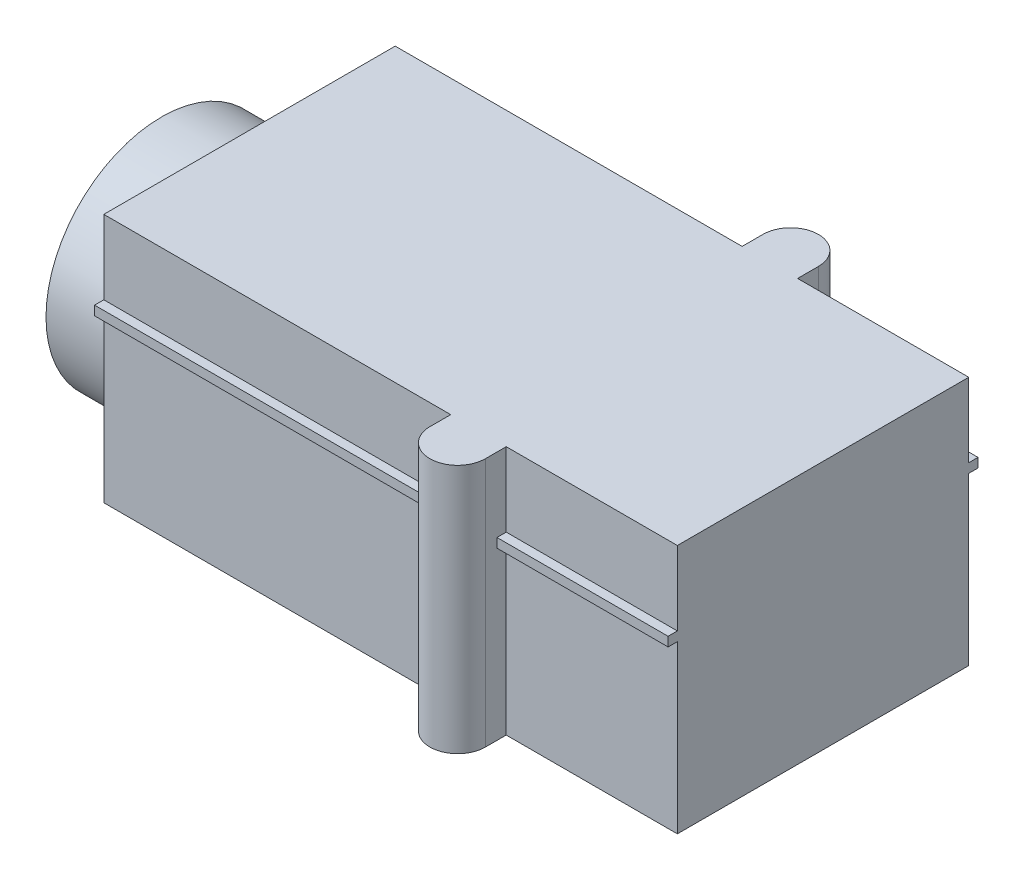
ISO-10303-21;
HEADER;
FILE_DESCRIPTION(('STEP AP214'),'2;1');
FILE_NAME('part.step','',(''),(''),'','','');
FILE_SCHEMA(('AUTOMOTIVE_DESIGN { 1 0 10303 214 1 1 1 1 }'));
ENDSEC;
DATA;
#1=APPLICATION_CONTEXT('core data for automotive mechanical design processes');
#2=APPLICATION_PROTOCOL_DEFINITION('international standard','automotive_design',2000,#1);
#3=PRODUCT_CONTEXT('',#1,'mechanical');
#4=PRODUCT('Part','Part','',(#3));
#5=PRODUCT_RELATED_PRODUCT_CATEGORY('part','',(#4));
#6=PRODUCT_DEFINITION_FORMATION('','',#4);
#7=PRODUCT_DEFINITION_CONTEXT('part definition',#1,'design');
#8=PRODUCT_DEFINITION('design','',#6,#7);
#9=PRODUCT_DEFINITION_SHAPE('','',#8);
#10=(LENGTH_UNIT() NAMED_UNIT(*) SI_UNIT(.MILLI.,.METRE.));
#11=(NAMED_UNIT(*) PLANE_ANGLE_UNIT() SI_UNIT($,.RADIAN.));
#12=(NAMED_UNIT(*) SI_UNIT($,.STERADIAN.) SOLID_ANGLE_UNIT());
#13=UNCERTAINTY_MEASURE_WITH_UNIT(LENGTH_MEASURE(1.E-05),#10,'distance_accuracy_value','');
#14=(GEOMETRIC_REPRESENTATION_CONTEXT(3) GLOBAL_UNCERTAINTY_ASSIGNED_CONTEXT((#13)) GLOBAL_UNIT_ASSIGNED_CONTEXT((#10,
#11,#12)) REPRESENTATION_CONTEXT('',''));
#15=CARTESIAN_POINT('',(0.,0.,0.));
#16=DIRECTION('',(0.,0.,1.));
#17=DIRECTION('',(1.,0.,0.));
#18=AXIS2_PLACEMENT_3D('',#15,#16,#17);
#19=CARTESIAN_POINT('',(7.5,5.4,3.15));
#20=DIRECTION('',(0.,0.,-1.));
#21=DIRECTION('',(-1.,0.,0.));
#22=AXIS2_PLACEMENT_3D('',#19,#20,#21);
#23=PLANE('',#22);
#24=DIRECTION('',(1.,0.,0.));
#25=VECTOR('',#24,1.);
#26=CARTESIAN_POINT('',(7.5,3.6,3.15));
#27=LINE('',#26,#25);
#28=CARTESIAN_POINT('',(0.,3.6,3.15));
#29=VERTEX_POINT('',#28);
#30=CARTESIAN_POINT('',(7.5,3.6,3.15));
#31=VERTEX_POINT('',#30);
#32=EDGE_CURVE('E48',#29,#31,#27,.T.);
#33=ORIENTED_EDGE('',*,*,#32,.F.);
#34=DIRECTION('',(0.,-1.,0.));
#35=VECTOR('',#34,1.);
#36=CARTESIAN_POINT('',(0.,5.4,3.15));
#37=LINE('',#36,#35);
#38=CARTESIAN_POINT('',(0.,0.,3.15));
#39=VERTEX_POINT('',#38);
#40=EDGE_CURVE('E355',#29,#39,#37,.T.);
#41=ORIENTED_EDGE('',*,*,#40,.T.);
#42=DIRECTION('',(1.,0.,0.));
#43=VECTOR('',#42,1.);
#44=CARTESIAN_POINT('',(7.5,0.,3.15));
#45=LINE('',#44,#43);
#46=CARTESIAN_POINT('',(7.5,0.,3.15));
#47=VERTEX_POINT('',#46);
#48=EDGE_CURVE('E325',#39,#47,#45,.T.);
#49=ORIENTED_EDGE('',*,*,#48,.T.);
#50=DIRECTION('',(0.,-1.,0.));
#51=VECTOR('',#50,1.);
#52=CARTESIAN_POINT('',(7.5,5.4,3.15));
#53=LINE('',#52,#51);
#54=EDGE_CURVE('E422',#31,#47,#53,.T.);
#55=ORIENTED_EDGE('',*,*,#54,.F.);
#56=EDGE_LOOP('',(#33,#41,#49,#55));
#57=FACE_BOUND('',#56,.T.);
#58=ADVANCED_FACE('F33',(#57),#23,.F.);
#59=CARTESIAN_POINT('',(12.4,5.4,3.15));
#60=DIRECTION('',(0.,0.,-1.));
#61=DIRECTION('',(-1.,0.,0.));
#62=AXIS2_PLACEMENT_3D('',#59,#60,#61);
#63=PLANE('',#62);
#64=DIRECTION('',(1.,0.,0.));
#65=VECTOR('',#64,1.);
#66=CARTESIAN_POINT('',(12.4,3.6,3.15));
#67=LINE('',#66,#65);
#68=CARTESIAN_POINT('',(8.7,3.6,3.15));
#69=VERTEX_POINT('',#68);
#70=CARTESIAN_POINT('',(12.4,3.6,3.15));
#71=VERTEX_POINT('',#70);
#72=EDGE_CURVE('E294',#69,#71,#67,.T.);
#73=ORIENTED_EDGE('',*,*,#72,.F.);
#74=DIRECTION('',(0.,-1.,0.));
#75=VECTOR('',#74,1.);
#76=CARTESIAN_POINT('',(8.7,5.4,3.15));
#77=LINE('',#76,#75);
#78=CARTESIAN_POINT('',(8.7,0.,3.15));
#79=VERTEX_POINT('',#78);
#80=EDGE_CURVE('E412',#69,#79,#77,.T.);
#81=ORIENTED_EDGE('',*,*,#80,.T.);
#82=DIRECTION('',(1.,0.,0.));
#83=VECTOR('',#82,1.);
#84=CARTESIAN_POINT('',(12.4,0.,3.15));
#85=LINE('',#84,#83);
#86=CARTESIAN_POINT('',(12.4,0.,3.15));
#87=VERTEX_POINT('',#86);
#88=EDGE_CURVE('E365',#79,#87,#85,.T.);
#89=ORIENTED_EDGE('',*,*,#88,.T.);
#90=DIRECTION('',(0.,-1.,0.));
#91=VECTOR('',#90,1.);
#92=CARTESIAN_POINT('',(12.4,5.4,3.15));
#93=LINE('',#92,#91);
#94=EDGE_CURVE('E408',#71,#87,#93,.T.);
#95=ORIENTED_EDGE('',*,*,#94,.F.);
#96=EDGE_LOOP('',(#73,#81,#89,#95));
#97=FACE_BOUND('',#96,.T.);
#98=ADVANCED_FACE('F502',(#97),#63,.F.);
#99=CARTESIAN_POINT('',(8.7,5.4,-3.15));
#100=DIRECTION('',(0.,0.,1.));
#101=DIRECTION('',(1.,0.,0.));
#102=AXIS2_PLACEMENT_3D('',#99,#100,#101);
#103=PLANE('',#102);
#104=DIRECTION('',(-1.,0.,0.));
#105=VECTOR('',#104,1.);
#106=CARTESIAN_POINT('',(8.7,3.6,-3.15));
#107=LINE('',#106,#105);
#108=CARTESIAN_POINT('',(12.4,3.6,-3.15));
#109=VERTEX_POINT('',#108);
#110=CARTESIAN_POINT('',(8.7,3.6,-3.15));
#111=VERTEX_POINT('',#110);
#112=EDGE_CURVE('E291',#109,#111,#107,.T.);
#113=ORIENTED_EDGE('',*,*,#112,.F.);
#114=DIRECTION('',(0.,-1.,0.));
#115=VECTOR('',#114,1.);
#116=CARTESIAN_POINT('',(12.4,5.4,-3.15));
#117=LINE('',#116,#115);
#118=CARTESIAN_POINT('',(12.4,0.,-3.15));
#119=VERTEX_POINT('',#118);
#120=EDGE_CURVE('E405',#109,#119,#117,.T.);
#121=ORIENTED_EDGE('',*,*,#120,.T.);
#122=DIRECTION('',(-1.,0.,0.));
#123=VECTOR('',#122,1.);
#124=CARTESIAN_POINT('',(8.7,0.,-3.15));
#125=LINE('',#124,#123);
#126=CARTESIAN_POINT('',(8.7,0.,-3.15));
#127=VERTEX_POINT('',#126);
#128=EDGE_CURVE('E371',#119,#127,#125,.T.);
#129=ORIENTED_EDGE('',*,*,#128,.T.);
#130=DIRECTION('',(0.,-1.,0.));
#131=VECTOR('',#130,1.);
#132=CARTESIAN_POINT('',(8.7,5.4,-3.15));
#133=LINE('',#132,#131);
#134=EDGE_CURVE('E401',#111,#127,#133,.T.);
#135=ORIENTED_EDGE('',*,*,#134,.F.);
#136=EDGE_LOOP('',(#113,#121,#129,#135));
#137=FACE_BOUND('',#136,.T.);
#138=ADVANCED_FACE('F492',(#137),#103,.F.);
#139=CARTESIAN_POINT('',(0.,5.4,-3.15));
#140=DIRECTION('',(0.,0.,1.));
#141=DIRECTION('',(1.,0.,0.));
#142=AXIS2_PLACEMENT_3D('',#139,#140,#141);
#143=PLANE('',#142);
#144=DIRECTION('',(-1.,0.,0.));
#145=VECTOR('',#144,1.);
#146=CARTESIAN_POINT('',(0.,3.6,-3.15));
#147=LINE('',#146,#145);
#148=CARTESIAN_POINT('',(7.5,3.6,-3.15));
#149=VERTEX_POINT('',#148);
#150=CARTESIAN_POINT('',(0.,3.6,-3.15));
#151=VERTEX_POINT('',#150);
#152=EDGE_CURVE('E426',#149,#151,#147,.T.);
#153=ORIENTED_EDGE('',*,*,#152,.F.);
#154=DIRECTION('',(0.,-1.,0.));
#155=VECTOR('',#154,1.);
#156=CARTESIAN_POINT('',(7.5,5.4,-3.15));
#157=LINE('',#156,#155);
#158=CARTESIAN_POINT('',(7.5,0.,-3.15));
#159=VERTEX_POINT('',#158);
#160=EDGE_CURVE('E391',#149,#159,#157,.T.);
#161=ORIENTED_EDGE('',*,*,#160,.T.);
#162=DIRECTION('',(-1.,0.,0.));
#163=VECTOR('',#162,1.);
#164=CARTESIAN_POINT('',(0.,0.,-3.15));
#165=LINE('',#164,#163);
#166=CARTESIAN_POINT('',(0.,0.,-3.15));
#167=VERTEX_POINT('',#166);
#168=EDGE_CURVE('E381',#159,#167,#165,.T.);
#169=ORIENTED_EDGE('',*,*,#168,.T.);
#170=DIRECTION('',(0.,-1.,0.));
#171=VECTOR('',#170,1.);
#172=CARTESIAN_POINT('',(0.,5.4,-3.15));
#173=LINE('',#172,#171);
#174=EDGE_CURVE('E389',#151,#167,#173,.T.);
#175=ORIENTED_EDGE('',*,*,#174,.F.);
#176=EDGE_LOOP('',(#153,#161,#169,#175));
#177=FACE_BOUND('',#176,.T.);
#178=ADVANCED_FACE('F440',(#177),#143,.F.);
#179=CARTESIAN_POINT('',(0.,5.4,3.15));
#180=DIRECTION('',(1.,0.,0.));
#181=DIRECTION('',(0.,0.,-1.));
#182=AXIS2_PLACEMENT_3D('',#179,#180,#181);
#183=PLANE('',#182);
#184=CARTESIAN_POINT('',(0.,5.4,-3.15));
#185=VERTEX_POINT('',#184);
#186=CARTESIAN_POINT('',(0.,3.8,-3.15));
#187=VERTEX_POINT('',#186);
#188=EDGE_CURVE('E234',#185,#187,#173,.T.);
#189=ORIENTED_EDGE('',*,*,#188,.T.);
#190=DIRECTION('',(0.,0.,-1.));
#191=VECTOR('',#190,1.);
#192=CARTESIAN_POINT('',(0.,3.8,-3.35));
#193=LINE('',#192,#191);
#194=CARTESIAN_POINT('',(0.,3.8,-3.35));
#195=VERTEX_POINT('',#194);
#196=EDGE_CURVE('E226',#187,#195,#193,.T.);
#197=ORIENTED_EDGE('',*,*,#196,.T.);
#198=DIRECTION('',(0.,-1.,0.));
#199=VECTOR('',#198,1.);
#200=CARTESIAN_POINT('',(0.,3.8,-3.35));
#201=LINE('',#200,#199);
#202=CARTESIAN_POINT('',(0.,3.6,-3.35));
#203=VERTEX_POINT('',#202);
#204=EDGE_CURVE('E230',#195,#203,#201,.T.);
#205=ORIENTED_EDGE('',*,*,#204,.T.);
#206=DIRECTION('',(0.,0.,-1.));
#207=VECTOR('',#206,1.);
#208=CARTESIAN_POINT('',(0.,3.6,-3.35));
#209=LINE('',#208,#207);
#210=EDGE_CURVE('E268',#151,#203,#209,.T.);
#211=ORIENTED_EDGE('',*,*,#210,.F.);
#212=ORIENTED_EDGE('',*,*,#174,.T.);
#213=DIRECTION('',(0.,0.,1.));
#214=VECTOR('',#213,1.);
#215=CARTESIAN_POINT('',(0.,0.,3.15));
#216=LINE('',#215,#214);
#217=CARTESIAN_POINT('',(0.,0.,-1.18743420870379));
#218=VERTEX_POINT('',#217);
#219=EDGE_CURVE('E333',#167,#218,#216,.T.);
#220=ORIENTED_EDGE('',*,*,#219,.T.);
#221=CARTESIAN_POINT('',(0.,2.2,0.));
#222=DIRECTION('',(-1.,0.,0.));
#223=DIRECTION('',(0.,0.,1.));
#224=AXIS2_PLACEMENT_3D('',#221,#222,#223);
#225=CIRCLE('',#224,2.5);
#226=CARTESIAN_POINT('',(0.,0.,1.18743420870379));
#227=VERTEX_POINT('',#226);
#228=EDGE_CURVE('E328',#227,#218,#225,.T.);
#229=ORIENTED_EDGE('',*,*,#228,.F.);
#230=EDGE_CURVE('E384',#227,#39,#216,.T.);
#231=ORIENTED_EDGE('',*,*,#230,.T.);
#232=ORIENTED_EDGE('',*,*,#40,.F.);
#233=CARTESIAN_POINT('',(0.,3.6,3.35));
#234=VERTEX_POINT('',#233);
#235=EDGE_CURVE('E264',#234,#29,#209,.T.);
#236=ORIENTED_EDGE('',*,*,#235,.F.);
#237=DIRECTION('',(0.,-1.,0.));
#238=VECTOR('',#237,1.);
#239=CARTESIAN_POINT('',(0.,3.8,3.35));
#240=LINE('',#239,#238);
#241=CARTESIAN_POINT('',(0.,3.8,3.35));
#242=VERTEX_POINT('',#241);
#243=EDGE_CURVE('E277',#242,#234,#240,.T.);
#244=ORIENTED_EDGE('',*,*,#243,.F.);
#245=CARTESIAN_POINT('',(0.,3.8,3.15));
#246=VERTEX_POINT('',#245);
#247=EDGE_CURVE('E238',#242,#246,#193,.T.);
#248=ORIENTED_EDGE('',*,*,#247,.T.);
#249=CARTESIAN_POINT('',(0.,5.4,3.15));
#250=VERTEX_POINT('',#249);
#251=EDGE_CURVE('E56',#250,#246,#37,.T.);
#252=ORIENTED_EDGE('',*,*,#251,.F.);
#253=DIRECTION('',(0.,0.,1.));
#254=VECTOR('',#253,1.);
#255=CARTESIAN_POINT('',(0.,5.4,3.15));
#256=LINE('',#255,#254);
#257=EDGE_CURVE('E353',#185,#250,#256,.T.);
#258=ORIENTED_EDGE('',*,*,#257,.F.);
#259=EDGE_LOOP('',(#189,#197,#205,#211,#212,#220,#229,#231,#232,#236,#244,#248,#252,#258));
#260=FACE_BOUND('',#259,.T.);
#261=ADVANCED_FACE('F228',(#260),#183,.F.);
#262=ORIENTED_EDGE('',*,*,#251,.T.);
#263=DIRECTION('',(1.,0.,0.));
#264=VECTOR('',#263,1.);
#265=CARTESIAN_POINT('',(7.5,3.8,3.15));
#266=LINE('',#265,#264);
#267=CARTESIAN_POINT('',(7.5,3.8,3.15));
#268=VERTEX_POINT('',#267);
#269=EDGE_CURVE('E315',#246,#268,#266,.T.);
#270=ORIENTED_EDGE('',*,*,#269,.T.);
#271=CARTESIAN_POINT('',(7.5,5.4,3.15));
#272=VERTEX_POINT('',#271);
#273=EDGE_CURVE('E423',#272,#268,#53,.T.);
#274=ORIENTED_EDGE('',*,*,#273,.F.);
#275=DIRECTION('',(1.,0.,0.));
#276=VECTOR('',#275,1.);
#277=CARTESIAN_POINT('',(7.5,5.4,3.15));
#278=LINE('',#277,#276);
#279=EDGE_CURVE('E329',#250,#272,#278,.T.);
#280=ORIENTED_EDGE('',*,*,#279,.F.);
#281=EDGE_LOOP('',(#262,#270,#274,#280));
#282=FACE_BOUND('',#281,.T.);
#283=ADVANCED_FACE('F35',(#282),#23,.F.);
#284=CARTESIAN_POINT('',(7.5,5.4,3.15));
#285=DIRECTION('',(1.,0.,0.));
#286=DIRECTION('',(0.,0.,-1.));
#287=AXIS2_PLACEMENT_3D('',#284,#285,#286);
#288=PLANE('',#287);
#289=ORIENTED_EDGE('',*,*,#273,.T.);
#290=DIRECTION('',(0.,0.,1.));
#291=VECTOR('',#290,1.);
#292=CARTESIAN_POINT('',(7.5,3.8,3.15));
#293=LINE('',#292,#291);
#294=CARTESIAN_POINT('',(7.5,3.8,3.35));
#295=VERTEX_POINT('',#294);
#296=EDGE_CURVE('E313',#268,#295,#293,.T.);
#297=ORIENTED_EDGE('',*,*,#296,.T.);
#298=DIRECTION('',(0.,-1.,0.));
#299=VECTOR('',#298,1.);
#300=CARTESIAN_POINT('',(7.5,5.4,3.35));
#301=LINE('',#300,#299);
#302=CARTESIAN_POINT('',(7.5,3.6,3.35));
#303=VERTEX_POINT('',#302);
#304=EDGE_CURVE('E319',#295,#303,#301,.T.);
#305=ORIENTED_EDGE('',*,*,#304,.T.);
#306=DIRECTION('',(0.,0.,1.));
#307=VECTOR('',#306,1.);
#308=CARTESIAN_POINT('',(7.5,3.6,3.15));
#309=LINE('',#308,#307);
#310=EDGE_CURVE('E300',#31,#303,#309,.T.);
#311=ORIENTED_EDGE('',*,*,#310,.F.);
#312=ORIENTED_EDGE('',*,*,#54,.T.);
#313=DIRECTION('',(0.,0.,1.));
#314=VECTOR('',#313,1.);
#315=CARTESIAN_POINT('',(7.5,0.,3.15));
#316=LINE('',#315,#314);
#317=CARTESIAN_POINT('',(7.5,0.,3.6));
#318=VERTEX_POINT('',#317);
#319=EDGE_CURVE('E358',#47,#318,#316,.T.);
#320=ORIENTED_EDGE('',*,*,#319,.T.);
#321=DIRECTION('',(0.,-1.,0.));
#322=VECTOR('',#321,1.);
#323=CARTESIAN_POINT('',(7.5,5.4,3.6));
#324=LINE('',#323,#322);
#325=CARTESIAN_POINT('',(7.5,5.4,3.6));
#326=VERTEX_POINT('',#325);
#327=EDGE_CURVE('E419',#326,#318,#324,.T.);
#328=ORIENTED_EDGE('',*,*,#327,.F.);
#329=DIRECTION('',(0.,0.,1.));
#330=VECTOR('',#329,1.);
#331=CARTESIAN_POINT('',(7.5,5.4,3.15));
#332=LINE('',#331,#330);
#333=EDGE_CURVE('E332',#272,#326,#332,.T.);
#334=ORIENTED_EDGE('',*,*,#333,.F.);
#335=EDGE_LOOP('',(#289,#297,#305,#311,#312,#320,#328,#334));
#336=FACE_BOUND('',#335,.T.);
#337=ADVANCED_FACE('F469',(#336),#288,.F.);
#338=CARTESIAN_POINT('',(8.1,5.4,3.6));
#339=DIRECTION('',(0.,-1.,0.));
#340=DIRECTION('',(0.,0.,-1.));
#341=AXIS2_PLACEMENT_3D('',#338,#339,#340);
#342=CYLINDRICAL_SURFACE('',#341,0.600000000000002);
#343=CARTESIAN_POINT('',(8.1,0.,3.6));
#344=DIRECTION('',(0.,1.,0.));
#345=DIRECTION('',(0.,0.,-1.));
#346=AXIS2_PLACEMENT_3D('',#343,#344,#345);
#347=CIRCLE('',#346,0.600000000000002);
#348=CARTESIAN_POINT('',(8.7,0.,3.6));
#349=VERTEX_POINT('',#348);
#350=EDGE_CURVE('E360',#318,#349,#347,.T.);
#351=ORIENTED_EDGE('',*,*,#350,.T.);
#352=DIRECTION('',(0.,-1.,0.));
#353=VECTOR('',#352,1.);
#354=CARTESIAN_POINT('',(8.7,5.4,3.6));
#355=LINE('',#354,#353);
#356=CARTESIAN_POINT('',(8.7,5.4,3.6));
#357=VERTEX_POINT('',#356);
#358=EDGE_CURVE('E416',#357,#349,#355,.T.);
#359=ORIENTED_EDGE('',*,*,#358,.F.);
#360=CARTESIAN_POINT('',(8.1,5.4,3.6));
#361=DIRECTION('',(0.,1.,0.));
#362=DIRECTION('',(0.,0.,-1.));
#363=AXIS2_PLACEMENT_3D('',#360,#361,#362);
#364=CIRCLE('',#363,0.600000000000002);
#365=EDGE_CURVE('E335',#326,#357,#364,.T.);
#366=ORIENTED_EDGE('',*,*,#365,.F.);
#367=ORIENTED_EDGE('',*,*,#327,.T.);
#368=EDGE_LOOP('',(#351,#359,#366,#367));
#369=FACE_BOUND('',#368,.T.);
#370=ADVANCED_FACE('F509',(#369),#342,.T.);
#371=CARTESIAN_POINT('',(8.7,5.4,3.6));
#372=DIRECTION('',(-1.,0.,0.));
#373=DIRECTION('',(0.,0.,1.));
#374=AXIS2_PLACEMENT_3D('',#371,#372,#373);
#375=PLANE('',#374);
#376=DIRECTION('',(0.,1.,0.));
#377=VECTOR('',#376,1.);
#378=CARTESIAN_POINT('',(8.7,5.4,3.35));
#379=LINE('',#378,#377);
#380=CARTESIAN_POINT('',(8.7,3.6,3.35));
#381=VERTEX_POINT('',#380);
#382=CARTESIAN_POINT('',(8.7,3.8,3.35));
#383=VERTEX_POINT('',#382);
#384=EDGE_CURVE('E11',#381,#383,#379,.T.);
#385=ORIENTED_EDGE('',*,*,#384,.T.);
#386=DIRECTION('',(0.,0.,-1.));
#387=VECTOR('',#386,1.);
#388=CARTESIAN_POINT('',(8.7,3.8,3.6));
#389=LINE('',#388,#387);
#390=CARTESIAN_POINT('',(8.7,3.8,3.15));
#391=VERTEX_POINT('',#390);
#392=EDGE_CURVE('E311',#383,#391,#389,.T.);
#393=ORIENTED_EDGE('',*,*,#392,.T.);
#394=CARTESIAN_POINT('',(8.7,5.4,3.15));
#395=VERTEX_POINT('',#394);
#396=EDGE_CURVE('E413',#395,#391,#77,.T.);
#397=ORIENTED_EDGE('',*,*,#396,.F.);
#398=DIRECTION('',(0.,0.,-1.));
#399=VECTOR('',#398,1.);
#400=CARTESIAN_POINT('',(8.7,5.4,3.6));
#401=LINE('',#400,#399);
#402=EDGE_CURVE('E337',#357,#395,#401,.T.);
#403=ORIENTED_EDGE('',*,*,#402,.F.);
#404=ORIENTED_EDGE('',*,*,#358,.T.);
#405=DIRECTION('',(0.,0.,-1.));
#406=VECTOR('',#405,1.);
#407=CARTESIAN_POINT('',(8.7,0.,3.6));
#408=LINE('',#407,#406);
#409=EDGE_CURVE('E362',#349,#79,#408,.T.);
#410=ORIENTED_EDGE('',*,*,#409,.T.);
#411=ORIENTED_EDGE('',*,*,#80,.F.);
#412=DIRECTION('',(0.,0.,-1.));
#413=VECTOR('',#412,1.);
#414=CARTESIAN_POINT('',(8.7,3.6,3.6));
#415=LINE('',#414,#413);
#416=EDGE_CURVE('E297',#381,#69,#415,.T.);
#417=ORIENTED_EDGE('',*,*,#416,.F.);
#418=EDGE_LOOP('',(#385,#393,#397,#403,#404,#410,#411,#417));
#419=FACE_BOUND('',#418,.T.);
#420=ADVANCED_FACE('F505',(#419),#375,.F.);
#421=ORIENTED_EDGE('',*,*,#396,.T.);
#422=DIRECTION('',(1.,0.,0.));
#423=VECTOR('',#422,1.);
#424=CARTESIAN_POINT('',(12.4,3.8,3.15));
#425=LINE('',#424,#423);
#426=CARTESIAN_POINT('',(12.4,3.8,3.15));
#427=VERTEX_POINT('',#426);
#428=EDGE_CURVE('E309',#391,#427,#425,.T.);
#429=ORIENTED_EDGE('',*,*,#428,.T.);
#430=CARTESIAN_POINT('',(12.4,5.4,3.15));
#431=VERTEX_POINT('',#430);
#432=EDGE_CURVE('E409',#431,#427,#93,.T.);
#433=ORIENTED_EDGE('',*,*,#432,.F.);
#434=DIRECTION('',(1.,0.,0.));
#435=VECTOR('',#434,1.);
#436=CARTESIAN_POINT('',(12.4,5.4,3.15));
#437=LINE('',#436,#435);
#438=EDGE_CURVE('E339',#395,#431,#437,.T.);
#439=ORIENTED_EDGE('',*,*,#438,.F.);
#440=EDGE_LOOP('',(#421,#429,#433,#439));
#441=FACE_BOUND('',#440,.T.);
#442=ADVANCED_FACE('F516',(#441),#63,.F.);
#443=CARTESIAN_POINT('',(12.4,5.4,-3.15));
#444=DIRECTION('',(-1.,0.,0.));
#445=DIRECTION('',(0.,0.,1.));
#446=AXIS2_PLACEMENT_3D('',#443,#444,#445);
#447=PLANE('',#446);
#448=ORIENTED_EDGE('',*,*,#432,.T.);
#449=DIRECTION('',(0.,0.,1.));
#450=VECTOR('',#449,1.);
#451=CARTESIAN_POINT('',(12.4,3.8,-3.35));
#452=LINE('',#451,#450);
#453=CARTESIAN_POINT('',(12.4,3.8,3.35));
#454=VERTEX_POINT('',#453);
#455=EDGE_CURVE('E254',#427,#454,#452,.T.);
#456=ORIENTED_EDGE('',*,*,#455,.T.);
#457=DIRECTION('',(0.,-1.,0.));
#458=VECTOR('',#457,1.);
#459=CARTESIAN_POINT('',(12.4,3.8,3.35));
#460=LINE('',#459,#458);
#461=CARTESIAN_POINT('',(12.4,3.6,3.35));
#462=VERTEX_POINT('',#461);
#463=EDGE_CURVE('E281',#454,#462,#460,.T.);
#464=ORIENTED_EDGE('',*,*,#463,.T.);
#465=DIRECTION('',(0.,0.,1.));
#466=VECTOR('',#465,1.);
#467=CARTESIAN_POINT('',(12.4,3.6,-3.35));
#468=LINE('',#467,#466);
#469=EDGE_CURVE('E270',#71,#462,#468,.T.);
#470=ORIENTED_EDGE('',*,*,#469,.F.);
#471=ORIENTED_EDGE('',*,*,#94,.T.);
#472=DIRECTION('',(0.,0.,-1.));
#473=VECTOR('',#472,1.);
#474=CARTESIAN_POINT('',(12.4,0.,-3.15));
#475=LINE('',#474,#473);
#476=EDGE_CURVE('E368',#87,#119,#475,.T.);
#477=ORIENTED_EDGE('',*,*,#476,.T.);
#478=ORIENTED_EDGE('',*,*,#120,.F.);
#479=CARTESIAN_POINT('',(12.4,3.6,-3.35));
#480=VERTEX_POINT('',#479);
#481=EDGE_CURVE('E271',#480,#109,#468,.T.);
#482=ORIENTED_EDGE('',*,*,#481,.F.);
#483=DIRECTION('',(0.,-1.,0.));
#484=VECTOR('',#483,1.);
#485=CARTESIAN_POINT('',(12.4,3.8,-3.35));
#486=LINE('',#485,#484);
#487=CARTESIAN_POINT('',(12.4,3.8,-3.35));
#488=VERTEX_POINT('',#487);
#489=EDGE_CURVE('E248',#488,#480,#486,.T.);
#490=ORIENTED_EDGE('',*,*,#489,.F.);
#491=CARTESIAN_POINT('',(12.4,3.8,-3.15));
#492=VERTEX_POINT('',#491);
#493=EDGE_CURVE('E257',#488,#492,#452,.T.);
#494=ORIENTED_EDGE('',*,*,#493,.T.);
#495=CARTESIAN_POINT('',(12.4,5.4,-3.15));
#496=VERTEX_POINT('',#495);
#497=EDGE_CURVE('E406',#496,#492,#117,.T.);
#498=ORIENTED_EDGE('',*,*,#497,.F.);
#499=DIRECTION('',(0.,0.,-1.));
#500=VECTOR('',#499,1.);
#501=CARTESIAN_POINT('',(12.4,5.4,-3.15));
#502=LINE('',#501,#500);
#503=EDGE_CURVE('E341',#431,#496,#502,.T.);
#504=ORIENTED_EDGE('',*,*,#503,.F.);
#505=EDGE_LOOP('',(#448,#456,#464,#470,#471,#477,#478,#482,#490,#494,#498,#504));
#506=FACE_BOUND('',#505,.T.);
#507=ADVANCED_FACE('F498',(#506),#447,.F.);
#508=ORIENTED_EDGE('',*,*,#497,.T.);
#509=DIRECTION('',(-1.,0.,0.));
#510=VECTOR('',#509,1.);
#511=CARTESIAN_POINT('',(8.7,3.8,-3.15));
#512=LINE('',#511,#510);
#513=CARTESIAN_POINT('',(8.7,3.8,-3.15));
#514=VERTEX_POINT('',#513);
#515=EDGE_CURVE('E307',#492,#514,#512,.T.);
#516=ORIENTED_EDGE('',*,*,#515,.T.);
#517=CARTESIAN_POINT('',(8.7,5.4,-3.15));
#518=VERTEX_POINT('',#517);
#519=EDGE_CURVE('E402',#518,#514,#133,.T.);
#520=ORIENTED_EDGE('',*,*,#519,.F.);
#521=DIRECTION('',(-1.,0.,0.));
#522=VECTOR('',#521,1.);
#523=CARTESIAN_POINT('',(8.7,5.4,-3.15));
#524=LINE('',#523,#522);
#525=EDGE_CURVE('E343',#496,#518,#524,.T.);
#526=ORIENTED_EDGE('',*,*,#525,.F.);
#527=EDGE_LOOP('',(#508,#516,#520,#526));
#528=FACE_BOUND('',#527,.T.);
#529=ADVANCED_FACE('F523',(#528),#103,.F.);
#530=CARTESIAN_POINT('',(8.7,5.4,-3.6));
#531=DIRECTION('',(-1.,0.,0.));
#532=DIRECTION('',(0.,0.,1.));
#533=AXIS2_PLACEMENT_3D('',#530,#531,#532);
#534=PLANE('',#533);
#535=ORIENTED_EDGE('',*,*,#519,.T.);
#536=DIRECTION('',(0.,0.,-1.));
#537=VECTOR('',#536,1.);
#538=CARTESIAN_POINT('',(8.7,3.8,-3.6));
#539=LINE('',#538,#537);
#540=CARTESIAN_POINT('',(8.7,3.8,-3.35));
#541=VERTEX_POINT('',#540);
#542=EDGE_CURVE('E305',#514,#541,#539,.T.);
#543=ORIENTED_EDGE('',*,*,#542,.T.);
#544=DIRECTION('',(0.,-1.,0.));
#545=VECTOR('',#544,1.);
#546=CARTESIAN_POINT('',(8.7,5.4,-3.35));
#547=LINE('',#546,#545);
#548=CARTESIAN_POINT('',(8.7,3.6,-3.35));
#549=VERTEX_POINT('',#548);
#550=EDGE_CURVE('E317',#541,#549,#547,.T.);
#551=ORIENTED_EDGE('',*,*,#550,.T.);
#552=DIRECTION('',(0.,0.,-1.));
#553=VECTOR('',#552,1.);
#554=CARTESIAN_POINT('',(8.7,3.6,-3.6));
#555=LINE('',#554,#553);
#556=EDGE_CURVE('E288',#111,#549,#555,.T.);
#557=ORIENTED_EDGE('',*,*,#556,.F.);
#558=ORIENTED_EDGE('',*,*,#134,.T.);
#559=DIRECTION('',(0.,0.,-1.));
#560=VECTOR('',#559,1.);
#561=CARTESIAN_POINT('',(8.7,0.,-3.6));
#562=LINE('',#561,#560);
#563=CARTESIAN_POINT('',(8.7,0.,-3.6));
#564=VERTEX_POINT('',#563);
#565=EDGE_CURVE('E374',#127,#564,#562,.T.);
#566=ORIENTED_EDGE('',*,*,#565,.T.);
#567=DIRECTION('',(0.,-1.,0.));
#568=VECTOR('',#567,1.);
#569=CARTESIAN_POINT('',(8.7,5.4,-3.6));
#570=LINE('',#569,#568);
#571=CARTESIAN_POINT('',(8.7,5.4,-3.6));
#572=VERTEX_POINT('',#571);
#573=EDGE_CURVE('E398',#572,#564,#570,.T.);
#574=ORIENTED_EDGE('',*,*,#573,.F.);
#575=DIRECTION('',(0.,0.,-1.));
#576=VECTOR('',#575,1.);
#577=CARTESIAN_POINT('',(8.7,5.4,-3.6));
#578=LINE('',#577,#576);
#579=EDGE_CURVE('E345',#518,#572,#578,.T.);
#580=ORIENTED_EDGE('',*,*,#579,.F.);
#581=EDGE_LOOP('',(#535,#543,#551,#557,#558,#566,#574,#580));
#582=FACE_BOUND('',#581,.T.);
#583=ADVANCED_FACE('F489',(#582),#534,.F.);
#584=CARTESIAN_POINT('',(8.1,5.4,-3.6));
#585=DIRECTION('',(0.,-1.,0.));
#586=DIRECTION('',(0.,0.,-1.));
#587=AXIS2_PLACEMENT_3D('',#584,#585,#586);
#588=CYLINDRICAL_SURFACE('',#587,0.600000000000002);
#589=CARTESIAN_POINT('',(8.1,0.,-3.6));
#590=DIRECTION('',(0.,1.,0.));
#591=DIRECTION('',(0.,0.,-1.));
#592=AXIS2_PLACEMENT_3D('',#589,#590,#591);
#593=CIRCLE('',#592,0.600000000000002);
#594=CARTESIAN_POINT('',(7.5,0.,-3.6));
#595=VERTEX_POINT('',#594);
#596=EDGE_CURVE('E376',#564,#595,#593,.T.);
#597=ORIENTED_EDGE('',*,*,#596,.T.);
#598=DIRECTION('',(0.,-1.,0.));
#599=VECTOR('',#598,1.);
#600=CARTESIAN_POINT('',(7.5,5.4,-3.6));
#601=LINE('',#600,#599);
#602=CARTESIAN_POINT('',(7.5,5.4,-3.6));
#603=VERTEX_POINT('',#602);
#604=EDGE_CURVE('E395',#603,#595,#601,.T.);
#605=ORIENTED_EDGE('',*,*,#604,.F.);
#606=CARTESIAN_POINT('',(8.1,5.4,-3.6));
#607=DIRECTION('',(0.,1.,0.));
#608=DIRECTION('',(0.,0.,-1.));
#609=AXIS2_PLACEMENT_3D('',#606,#607,#608);
#610=CIRCLE('',#609,0.600000000000002);
#611=EDGE_CURVE('E347',#572,#603,#610,.T.);
#612=ORIENTED_EDGE('',*,*,#611,.F.);
#613=ORIENTED_EDGE('',*,*,#573,.T.);
#614=EDGE_LOOP('',(#597,#605,#612,#613));
#615=FACE_BOUND('',#614,.T.);
#616=ADVANCED_FACE('F485',(#615),#588,.T.);
#617=CARTESIAN_POINT('',(7.5,5.4,-3.15));
#618=DIRECTION('',(1.,0.,0.));
#619=DIRECTION('',(0.,0.,-1.));
#620=AXIS2_PLACEMENT_3D('',#617,#618,#619);
#621=PLANE('',#620);
#622=DIRECTION('',(0.,1.,0.));
#623=VECTOR('',#622,1.);
#624=CARTESIAN_POINT('',(7.5,5.4,-3.35));
#625=LINE('',#624,#623);
#626=CARTESIAN_POINT('',(7.5,3.6,-3.35));
#627=VERTEX_POINT('',#626);
#628=CARTESIAN_POINT('',(7.5,3.8,-3.35));
#629=VERTEX_POINT('',#628);
#630=EDGE_CURVE('E41',#627,#629,#625,.T.);
#631=ORIENTED_EDGE('',*,*,#630,.T.);
#632=DIRECTION('',(0.,0.,1.));
#633=VECTOR('',#632,1.);
#634=CARTESIAN_POINT('',(7.5,3.8,-3.15));
#635=LINE('',#634,#633);
#636=CARTESIAN_POINT('',(7.5,3.8,-3.15));
#637=VERTEX_POINT('',#636);
#638=EDGE_CURVE('E253',#629,#637,#635,.T.);
#639=ORIENTED_EDGE('',*,*,#638,.T.);
#640=CARTESIAN_POINT('',(7.5,5.4,-3.15));
#641=VERTEX_POINT('',#640);
#642=EDGE_CURVE('E392',#641,#637,#157,.T.);
#643=ORIENTED_EDGE('',*,*,#642,.F.);
#644=DIRECTION('',(0.,0.,1.));
#645=VECTOR('',#644,1.);
#646=CARTESIAN_POINT('',(7.5,5.4,-3.15));
#647=LINE('',#646,#645);
#648=EDGE_CURVE('E349',#603,#641,#647,.T.);
#649=ORIENTED_EDGE('',*,*,#648,.F.);
#650=ORIENTED_EDGE('',*,*,#604,.T.);
#651=DIRECTION('',(0.,0.,1.));
#652=VECTOR('',#651,1.);
#653=CARTESIAN_POINT('',(7.5,0.,-3.15));
#654=LINE('',#653,#652);
#655=EDGE_CURVE('E378',#595,#159,#654,.T.);
#656=ORIENTED_EDGE('',*,*,#655,.T.);
#657=ORIENTED_EDGE('',*,*,#160,.F.);
#658=DIRECTION('',(0.,0.,1.));
#659=VECTOR('',#658,1.);
#660=CARTESIAN_POINT('',(7.5,3.6,-3.15));
#661=LINE('',#660,#659);
#662=EDGE_CURVE('E280',#627,#149,#661,.T.);
#663=ORIENTED_EDGE('',*,*,#662,.F.);
#664=EDGE_LOOP('',(#631,#639,#643,#649,#650,#656,#657,#663));
#665=FACE_BOUND('',#664,.T.);
#666=ADVANCED_FACE('F431',(#665),#621,.F.);
#667=ORIENTED_EDGE('',*,*,#642,.T.);
#668=DIRECTION('',(-1.,0.,0.));
#669=VECTOR('',#668,1.);
#670=CARTESIAN_POINT('',(0.,3.8,-3.15));
#671=LINE('',#670,#669);
#672=EDGE_CURVE('E429',#637,#187,#671,.T.);
#673=ORIENTED_EDGE('',*,*,#672,.T.);
#674=ORIENTED_EDGE('',*,*,#188,.F.);
#675=DIRECTION('',(-1.,0.,0.));
#676=VECTOR('',#675,1.);
#677=CARTESIAN_POINT('',(0.,5.4,-3.15));
#678=LINE('',#677,#676);
#679=EDGE_CURVE('E351',#641,#185,#678,.T.);
#680=ORIENTED_EDGE('',*,*,#679,.F.);
#681=EDGE_LOOP('',(#667,#673,#674,#680));
#682=FACE_BOUND('',#681,.T.);
#683=ADVANCED_FACE('F478',(#682),#143,.F.);
#684=CARTESIAN_POINT('',(8.1,5.4,-3.6));
#685=DIRECTION('',(0.,-1.,0.));
#686=DIRECTION('',(0.,0.,-1.));
#687=AXIS2_PLACEMENT_3D('',#684,#685,#686);
#688=PLANE('',#687);
#689=ORIENTED_EDGE('',*,*,#279,.T.);
#690=ORIENTED_EDGE('',*,*,#333,.T.);
#691=ORIENTED_EDGE('',*,*,#365,.T.);
#692=ORIENTED_EDGE('',*,*,#402,.T.);
#693=ORIENTED_EDGE('',*,*,#438,.T.);
#694=ORIENTED_EDGE('',*,*,#503,.T.);
#695=ORIENTED_EDGE('',*,*,#525,.T.);
#696=ORIENTED_EDGE('',*,*,#579,.T.);
#697=ORIENTED_EDGE('',*,*,#611,.T.);
#698=ORIENTED_EDGE('',*,*,#648,.T.);
#699=ORIENTED_EDGE('',*,*,#679,.T.);
#700=ORIENTED_EDGE('',*,*,#257,.T.);
#701=EDGE_LOOP('',(#689,#690,#691,#692,#693,#694,#695,#696,#697,#698,#699,#700));
#702=FACE_BOUND('',#701,.T.);
#703=ADVANCED_FACE('F474',(#702),#688,.F.);
#704=CARTESIAN_POINT('',(8.1,0.,-3.6));
#705=DIRECTION('',(0.,-1.,0.));
#706=DIRECTION('',(0.,0.,-1.));
#707=AXIS2_PLACEMENT_3D('',#704,#705,#706);
#708=PLANE('',#707);
#709=ORIENTED_EDGE('',*,*,#48,.F.);
#710=ORIENTED_EDGE('',*,*,#230,.F.);
#711=EDGE_CURVE('E387',#218,#227,#216,.T.);
#712=ORIENTED_EDGE('',*,*,#711,.F.);
#713=ORIENTED_EDGE('',*,*,#219,.F.);
#714=ORIENTED_EDGE('',*,*,#168,.F.);
#715=ORIENTED_EDGE('',*,*,#655,.F.);
#716=ORIENTED_EDGE('',*,*,#596,.F.);
#717=ORIENTED_EDGE('',*,*,#565,.F.);
#718=ORIENTED_EDGE('',*,*,#128,.F.);
#719=ORIENTED_EDGE('',*,*,#476,.F.);
#720=ORIENTED_EDGE('',*,*,#88,.F.);
#721=ORIENTED_EDGE('',*,*,#409,.F.);
#722=ORIENTED_EDGE('',*,*,#350,.F.);
#723=ORIENTED_EDGE('',*,*,#319,.F.);
#724=EDGE_LOOP('',(#709,#710,#712,#713,#714,#715,#716,#717,#718,#719,#720,#721,#722,#723));
#725=FACE_BOUND('',#724,.T.);
#726=ADVANCED_FACE('F444',(#725),#708,.T.);
#727=CARTESIAN_POINT('',(0.,2.2,0.));
#728=DIRECTION('',(-1.,0.,0.));
#729=DIRECTION('',(0.,0.,1.));
#730=AXIS2_PLACEMENT_3D('',#727,#728,#729);
#731=PLANE('',#730);
#732=EDGE_CURVE('E321',#218,#227,#225,.T.);
#733=ORIENTED_EDGE('',*,*,#732,.F.);
#734=ORIENTED_EDGE('',*,*,#711,.T.);
#735=EDGE_LOOP('',(#733,#734));
#736=FACE_BOUND('',#735,.T.);
#737=ADVANCED_FACE('F450',(#736),#731,.F.);
#738=CARTESIAN_POINT('',(-1.9,2.2,0.));
#739=DIRECTION('',(1.,0.,0.));
#740=DIRECTION('',(0.,0.,-1.));
#741=AXIS2_PLACEMENT_3D('',#738,#739,#740);
#742=CYLINDRICAL_SURFACE('',#741,2.5);
#743=CARTESIAN_POINT('',(-1.9,2.2,0.));
#744=DIRECTION('',(-1.,0.,0.));
#745=DIRECTION('',(0.,0.,1.));
#746=AXIS2_PLACEMENT_3D('',#743,#744,#745);
#747=CIRCLE('',#746,2.5);
#748=CARTESIAN_POINT('',(-1.9,2.2,2.5));
#749=VERTEX_POINT('',#748);
#750=EDGE_CURVE('E322',#749,#749,#747,.T.);
#751=ORIENTED_EDGE('',*,*,#750,.F.);
#752=EDGE_LOOP('',(#751));
#753=FACE_BOUND('',#752,.T.);
#754=ORIENTED_EDGE('',*,*,#732,.T.);
#755=ORIENTED_EDGE('',*,*,#228,.T.);
#756=EDGE_LOOP('',(#754,#755));
#757=FACE_BOUND('',#756,.T.);
#758=ADVANCED_FACE('F452',(#753,#757),#742,.T.);
#759=CARTESIAN_POINT('',(-1.9,2.2,0.));
#760=DIRECTION('',(-1.,0.,0.));
#761=DIRECTION('',(0.,0.,1.));
#762=AXIS2_PLACEMENT_3D('',#759,#760,#761);
#763=PLANE('',#762);
#764=ORIENTED_EDGE('',*,*,#750,.T.);
#765=EDGE_LOOP('',(#764));
#766=FACE_BOUND('',#765,.T.);
#767=ADVANCED_FACE('F549',(#766),#763,.T.);
#768=CARTESIAN_POINT('',(0.,3.6,0.));
#769=DIRECTION('',(0.,1.,0.));
#770=DIRECTION('',(0.,0.,1.));
#771=AXIS2_PLACEMENT_3D('',#768,#769,#770);
#772=PLANE('',#771);
#773=DIRECTION('',(1.,0.,0.));
#774=VECTOR('',#773,1.);
#775=CARTESIAN_POINT('',(0.,3.6,-3.35));
#776=LINE('',#775,#774);
#777=EDGE_CURVE('E247',#203,#627,#776,.T.);
#778=ORIENTED_EDGE('',*,*,#777,.T.);
#779=ORIENTED_EDGE('',*,*,#662,.T.);
#780=ORIENTED_EDGE('',*,*,#152,.T.);
#781=ORIENTED_EDGE('',*,*,#210,.T.);
#782=EDGE_LOOP('',(#778,#779,#780,#781));
#783=FACE_BOUND('',#782,.T.);
#784=ADVANCED_FACE('F435',(#783),#772,.F.);
#785=CARTESIAN_POINT('',(0.,3.8,0.));
#786=DIRECTION('',(0.,1.,0.));
#787=DIRECTION('',(0.,0.,1.));
#788=AXIS2_PLACEMENT_3D('',#785,#786,#787);
#789=PLANE('',#788);
#790=ORIENTED_EDGE('',*,*,#638,.F.);
#791=DIRECTION('',(1.,0.,0.));
#792=VECTOR('',#791,1.);
#793=CARTESIAN_POINT('',(0.,3.8,-3.35));
#794=LINE('',#793,#792);
#795=EDGE_CURVE('E245',#195,#629,#794,.T.);
#796=ORIENTED_EDGE('',*,*,#795,.F.);
#797=ORIENTED_EDGE('',*,*,#196,.F.);
#798=ORIENTED_EDGE('',*,*,#672,.F.);
#799=EDGE_LOOP('',(#790,#796,#797,#798));
#800=FACE_BOUND('',#799,.T.);
#801=ADVANCED_FACE('F252',(#800),#789,.T.);
#802=CARTESIAN_POINT('',(0.,3.8,-3.35));
#803=DIRECTION('',(0.,0.,-1.));
#804=DIRECTION('',(-1.,0.,0.));
#805=AXIS2_PLACEMENT_3D('',#802,#803,#804);
#806=PLANE('',#805);
#807=ORIENTED_EDGE('',*,*,#630,.F.);
#808=ORIENTED_EDGE('',*,*,#777,.F.);
#809=ORIENTED_EDGE('',*,*,#204,.F.);
#810=ORIENTED_EDGE('',*,*,#795,.T.);
#811=EDGE_LOOP('',(#807,#808,#809,#810));
#812=FACE_BOUND('',#811,.T.);
#813=ADVANCED_FACE('F244',(#812),#806,.T.);
#814=ORIENTED_EDGE('',*,*,#481,.T.);
#815=ORIENTED_EDGE('',*,*,#112,.T.);
#816=ORIENTED_EDGE('',*,*,#556,.T.);
#817=EDGE_CURVE('E267',#549,#480,#776,.T.);
#818=ORIENTED_EDGE('',*,*,#817,.T.);
#819=EDGE_LOOP('',(#814,#815,#816,#818));
#820=FACE_BOUND('',#819,.T.);
#821=ADVANCED_FACE('F536',(#820),#772,.F.);
#822=ORIENTED_EDGE('',*,*,#515,.F.);
#823=ORIENTED_EDGE('',*,*,#493,.F.);
#824=EDGE_CURVE('E255',#541,#488,#794,.T.);
#825=ORIENTED_EDGE('',*,*,#824,.F.);
#826=ORIENTED_EDGE('',*,*,#542,.F.);
#827=EDGE_LOOP('',(#822,#823,#825,#826));
#828=FACE_BOUND('',#827,.T.);
#829=ADVANCED_FACE('F529',(#828),#789,.T.);
#830=ORIENTED_EDGE('',*,*,#550,.F.);
#831=ORIENTED_EDGE('',*,*,#824,.T.);
#832=ORIENTED_EDGE('',*,*,#489,.T.);
#833=ORIENTED_EDGE('',*,*,#817,.F.);
#834=EDGE_LOOP('',(#830,#831,#832,#833));
#835=FACE_BOUND('',#834,.T.);
#836=ADVANCED_FACE('F533',(#835),#806,.T.);
#837=DIRECTION('',(-1.,0.,0.));
#838=VECTOR('',#837,1.);
#839=CARTESIAN_POINT('',(0.,3.6,3.35));
#840=LINE('',#839,#838);
#841=EDGE_CURVE('E239',#462,#381,#840,.T.);
#842=ORIENTED_EDGE('',*,*,#841,.T.);
#843=ORIENTED_EDGE('',*,*,#416,.T.);
#844=ORIENTED_EDGE('',*,*,#72,.T.);
#845=ORIENTED_EDGE('',*,*,#469,.T.);
#846=EDGE_LOOP('',(#842,#843,#844,#845));
#847=FACE_BOUND('',#846,.T.);
#848=ADVANCED_FACE('F539',(#847),#772,.F.);
#849=ORIENTED_EDGE('',*,*,#392,.F.);
#850=DIRECTION('',(-1.,0.,0.));
#851=VECTOR('',#850,1.);
#852=CARTESIAN_POINT('',(0.,3.8,3.35));
#853=LINE('',#852,#851);
#854=EDGE_CURVE('E249',#454,#383,#853,.T.);
#855=ORIENTED_EDGE('',*,*,#854,.F.);
#856=ORIENTED_EDGE('',*,*,#455,.F.);
#857=ORIENTED_EDGE('',*,*,#428,.F.);
#858=EDGE_LOOP('',(#849,#855,#856,#857));
#859=FACE_BOUND('',#858,.T.);
#860=ADVANCED_FACE('F545',(#859),#789,.T.);
#861=CARTESIAN_POINT('',(0.,3.8,3.35));
#862=DIRECTION('',(0.,0.,1.));
#863=DIRECTION('',(1.,0.,0.));
#864=AXIS2_PLACEMENT_3D('',#861,#862,#863);
#865=PLANE('',#864);
#866=ORIENTED_EDGE('',*,*,#384,.F.);
#867=ORIENTED_EDGE('',*,*,#841,.F.);
#868=ORIENTED_EDGE('',*,*,#463,.F.);
#869=ORIENTED_EDGE('',*,*,#854,.T.);
#870=EDGE_LOOP('',(#866,#867,#868,#869));
#871=FACE_BOUND('',#870,.T.);
#872=ADVANCED_FACE('F696',(#871),#865,.T.);
#873=ORIENTED_EDGE('',*,*,#304,.F.);
#874=EDGE_CURVE('E261',#295,#242,#853,.T.);
#875=ORIENTED_EDGE('',*,*,#874,.T.);
#876=ORIENTED_EDGE('',*,*,#243,.T.);
#877=EDGE_CURVE('E274',#303,#234,#840,.T.);
#878=ORIENTED_EDGE('',*,*,#877,.F.);
#879=EDGE_LOOP('',(#873,#875,#876,#878));
#880=FACE_BOUND('',#879,.T.);
#881=ADVANCED_FACE('F705',(#880),#865,.T.);
#882=ORIENTED_EDGE('',*,*,#269,.F.);
#883=ORIENTED_EDGE('',*,*,#247,.F.);
#884=ORIENTED_EDGE('',*,*,#874,.F.);
#885=ORIENTED_EDGE('',*,*,#296,.F.);
#886=EDGE_LOOP('',(#882,#883,#884,#885));
#887=FACE_BOUND('',#886,.T.);
#888=ADVANCED_FACE('F466',(#887),#789,.T.);
#889=ORIENTED_EDGE('',*,*,#235,.T.);
#890=ORIENTED_EDGE('',*,*,#32,.T.);
#891=ORIENTED_EDGE('',*,*,#310,.T.);
#892=ORIENTED_EDGE('',*,*,#877,.T.);
#893=EDGE_LOOP('',(#889,#890,#891,#892));
#894=FACE_BOUND('',#893,.T.);
#895=ADVANCED_FACE('F458',(#894),#772,.F.);
#896=CLOSED_SHELL('',(#58,#98,#138,#178,#261,#283,#337,#370,#420,#442,#507,#529,#583,#616,#666,
#683,#703,#726,#737,#758,#767,#784,#801,#813,#821,#829,#836,#848,#860,#872,#881,#888,#895));
#897=MANIFOLD_SOLID_BREP('B2',#896);
#898=ADVANCED_BREP_SHAPE_REPRESENTATION('',(#18,#897),#14);
#899=SHAPE_DEFINITION_REPRESENTATION(#9,#898);
ENDSEC;
END-ISO-10303-21;
